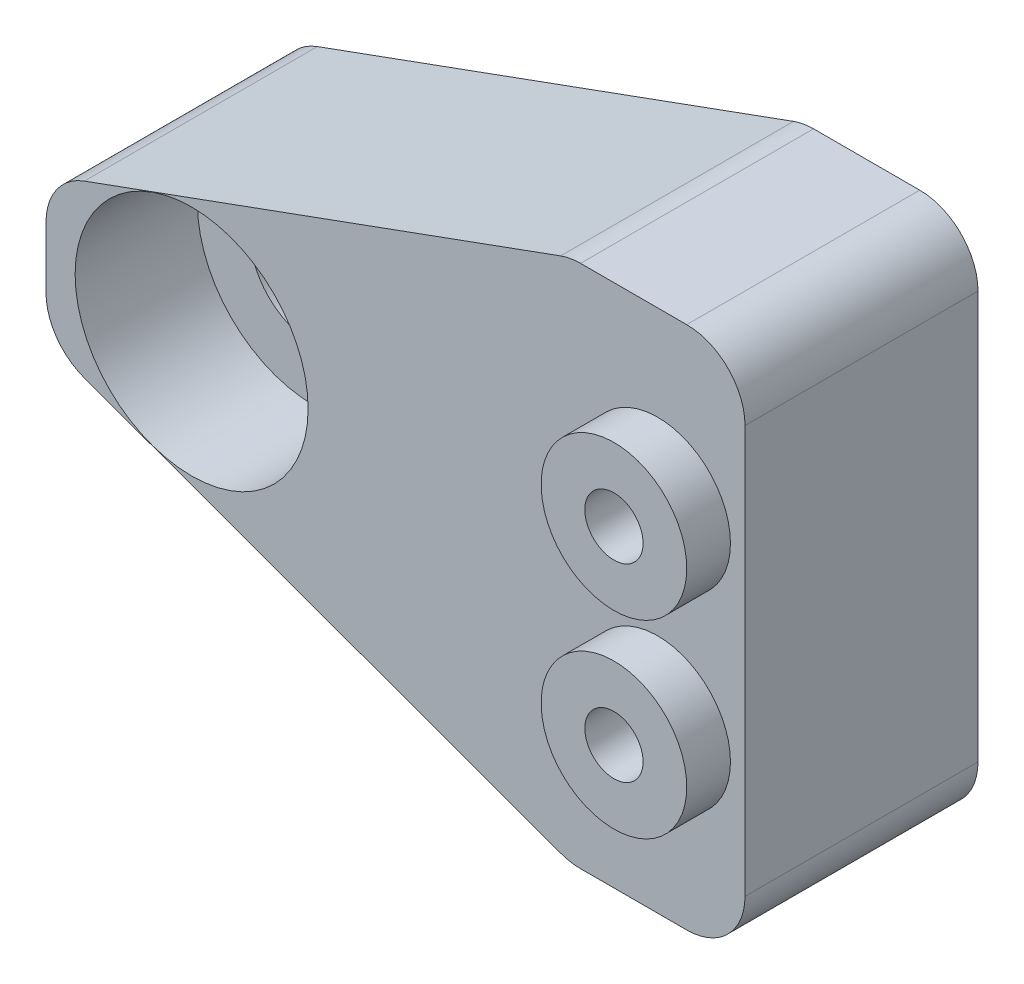
ISO-10303-21;
HEADER;
FILE_DESCRIPTION(('STEP AP214'),'2;1');
FILE_NAME('part.step','',(''),(''),'','','');
FILE_SCHEMA(('AUTOMOTIVE_DESIGN { 1 0 10303 214 1 1 1 1 }'));
ENDSEC;
DATA;
#1=APPLICATION_CONTEXT('core data for automotive mechanical design processes');
#2=APPLICATION_PROTOCOL_DEFINITION('international standard','automotive_design',2000,#1);
#3=PRODUCT_CONTEXT('',#1,'mechanical');
#4=PRODUCT('Part','Part','',(#3));
#5=PRODUCT_RELATED_PRODUCT_CATEGORY('part','',(#4));
#6=PRODUCT_DEFINITION_FORMATION('','',#4);
#7=PRODUCT_DEFINITION_CONTEXT('part definition',#1,'design');
#8=PRODUCT_DEFINITION('design','',#6,#7);
#9=PRODUCT_DEFINITION_SHAPE('','',#8);
#10=(LENGTH_UNIT() NAMED_UNIT(*) SI_UNIT(.MILLI.,.METRE.));
#11=(NAMED_UNIT(*) PLANE_ANGLE_UNIT() SI_UNIT($,.RADIAN.));
#12=(NAMED_UNIT(*) SI_UNIT($,.STERADIAN.) SOLID_ANGLE_UNIT());
#13=UNCERTAINTY_MEASURE_WITH_UNIT(LENGTH_MEASURE(1.E-05),#10,'distance_accuracy_value','');
#14=(GEOMETRIC_REPRESENTATION_CONTEXT(3) GLOBAL_UNCERTAINTY_ASSIGNED_CONTEXT((#13)) GLOBAL_UNIT_ASSIGNED_CONTEXT((#10,
#11,#12)) REPRESENTATION_CONTEXT('',''));
#15=CARTESIAN_POINT('',(0.,0.,0.));
#16=DIRECTION('',(0.,0.,1.));
#17=DIRECTION('',(1.,0.,0.));
#18=AXIS2_PLACEMENT_3D('',#15,#16,#17);
#19=CARTESIAN_POINT('',(0.,0.,8.));
#20=DIRECTION('',(0.,0.,1.));
#21=DIRECTION('',(1.,0.,0.));
#22=AXIS2_PLACEMENT_3D('',#19,#20,#21);
#23=PLANE('',#22);
#24=CARTESIAN_POINT('',(13.,-3.25,8.));
#25=DIRECTION('',(0.,0.,1.));
#26=DIRECTION('',(1.,0.,0.));
#27=AXIS2_PLACEMENT_3D('',#24,#25,#26);
#28=CIRCLE('',#27,2.5);
#29=CARTESIAN_POINT('',(15.5,-3.25,8.));
#30=VERTEX_POINT('',#29);
#31=EDGE_CURVE('E333',#30,#30,#28,.T.);
#32=ORIENTED_EDGE('',*,*,#31,.F.);
#33=EDGE_LOOP('',(#32));
#34=FACE_BOUND('',#33,.T.);
#35=CARTESIAN_POINT('',(-3.,0.,8.));
#36=DIRECTION('',(0.,0.,1.));
#37=DIRECTION('',(1.,0.,0.));
#38=AXIS2_PLACEMENT_3D('',#35,#36,#37);
#39=CIRCLE('',#38,4.);
#40=CARTESIAN_POINT('',(0.999999999999998,0.,8.));
#41=VERTEX_POINT('',#40);
#42=EDGE_CURVE('E315',#41,#41,#39,.T.);
#43=ORIENTED_EDGE('',*,*,#42,.F.);
#44=EDGE_LOOP('',(#43));
#45=FACE_BOUND('',#44,.T.);
#46=DIRECTION('',(-0.93969262078591,0.342020143325666,0.));
#47=VECTOR('',#46,1.);
#48=CARTESIAN_POINT('',(-1.72276645918429,-4.73326194560269,8.));
#49=LINE('',#48,#47);
#50=CARTESIAN_POINT('',(-6.68404028665133,-2.92750594836075,8.));
#51=VERTEX_POINT('',#50);
#52=CARTESIAN_POINT('',(9.66861367476577,-8.87938524157182,8.));
#53=VERTEX_POINT('',#52);
#54=EDGE_CURVE('E129',#51,#53,#49,.F.);
#55=ORIENTED_EDGE('',*,*,#54,.T.);
#56=CARTESIAN_POINT('',(10.3526539614171,-7.,8.));
#57=DIRECTION('',(0.,0.,1.));
#58=DIRECTION('',(1.,0.,0.));
#59=AXIS2_PLACEMENT_3D('',#56,#57,#58);
#60=CIRCLE('',#59,2.);
#61=CARTESIAN_POINT('',(10.3526539614171,-9.,8.));
#62=VERTEX_POINT('',#61);
#63=EDGE_CURVE('E123',#53,#62,#60,.T.);
#64=ORIENTED_EDGE('',*,*,#63,.T.);
#65=DIRECTION('',(1.,0.,0.));
#66=VECTOR('',#65,1.);
#67=CARTESIAN_POINT('',(-8.,-9.,8.));
#68=LINE('',#67,#66);
#69=CARTESIAN_POINT('',(14.,-9.,8.));
#70=VERTEX_POINT('',#69);
#71=EDGE_CURVE('E126',#62,#70,#68,.T.);
#72=ORIENTED_EDGE('',*,*,#71,.T.);
#73=CARTESIAN_POINT('',(14.,-7.,8.));
#74=DIRECTION('',(0.,0.,1.));
#75=DIRECTION('',(1.,0.,0.));
#76=AXIS2_PLACEMENT_3D('',#73,#74,#75);
#77=CIRCLE('',#76,2.);
#78=CARTESIAN_POINT('',(16.,-7.,8.));
#79=VERTEX_POINT('',#78);
#80=EDGE_CURVE('E134',#70,#79,#77,.T.);
#81=ORIENTED_EDGE('',*,*,#80,.T.);
#82=DIRECTION('',(0.,1.,0.));
#83=VECTOR('',#82,1.);
#84=CARTESIAN_POINT('',(16.,9.,8.));
#85=LINE('',#84,#83);
#86=CARTESIAN_POINT('',(16.,7.,8.));
#87=VERTEX_POINT('',#86);
#88=EDGE_CURVE('E144',#79,#87,#85,.T.);
#89=ORIENTED_EDGE('',*,*,#88,.T.);
#90=CARTESIAN_POINT('',(14.,7.,8.));
#91=DIRECTION('',(0.,0.,1.));
#92=DIRECTION('',(1.,0.,0.));
#93=AXIS2_PLACEMENT_3D('',#90,#91,#92);
#94=CIRCLE('',#93,2.);
#95=CARTESIAN_POINT('',(14.,9.,8.));
#96=VERTEX_POINT('',#95);
#97=EDGE_CURVE('E173',#87,#96,#94,.T.);
#98=ORIENTED_EDGE('',*,*,#97,.T.);
#99=DIRECTION('',(-1.,0.,0.));
#100=VECTOR('',#99,1.);
#101=CARTESIAN_POINT('',(-8.,9.,8.));
#102=LINE('',#101,#100);
#103=CARTESIAN_POINT('',(10.3526539614171,9.,8.));
#104=VERTEX_POINT('',#103);
#105=EDGE_CURVE('E214',#96,#104,#102,.T.);
#106=ORIENTED_EDGE('',*,*,#105,.T.);
#107=CARTESIAN_POINT('',(10.3526539614171,7.,8.));
#108=DIRECTION('',(0.,0.,1.));
#109=DIRECTION('',(1.,0.,0.));
#110=AXIS2_PLACEMENT_3D('',#107,#108,#109);
#111=CIRCLE('',#110,2.);
#112=CARTESIAN_POINT('',(9.66861367476575,8.87938524157182,8.));
#113=VERTEX_POINT('',#112);
#114=EDGE_CURVE('E55',#104,#113,#111,.T.);
#115=ORIENTED_EDGE('',*,*,#114,.T.);
#116=DIRECTION('',(0.939692620785909,0.342020143325666,0.));
#117=VECTOR('',#116,1.);
#118=CARTESIAN_POINT('',(-1.7227664591843,4.73326194560269,8.));
#119=LINE('',#118,#117);
#120=CARTESIAN_POINT('',(-6.68404028665133,2.92750594836075,8.));
#121=VERTEX_POINT('',#120);
#122=EDGE_CURVE('E235',#113,#121,#119,.F.);
#123=ORIENTED_EDGE('',*,*,#122,.T.);
#124=CARTESIAN_POINT('',(-6.,1.04812070678893,8.));
#125=DIRECTION('',(0.,0.,1.));
#126=DIRECTION('',(1.,0.,0.));
#127=AXIS2_PLACEMENT_3D('',#124,#125,#126);
#128=CIRCLE('',#127,2.);
#129=CARTESIAN_POINT('',(-8.,1.04812070678893,8.));
#130=VERTEX_POINT('',#129);
#131=EDGE_CURVE('E168',#121,#130,#128,.T.);
#132=ORIENTED_EDGE('',*,*,#131,.T.);
#133=DIRECTION('',(0.,-1.,0.));
#134=VECTOR('',#133,1.);
#135=CARTESIAN_POINT('',(-8.,9.,8.));
#136=LINE('',#135,#134);
#137=CARTESIAN_POINT('',(-8.,-1.04812070678893,8.));
#138=VERTEX_POINT('',#137);
#139=EDGE_CURVE('E145',#130,#138,#136,.T.);
#140=ORIENTED_EDGE('',*,*,#139,.T.);
#141=CARTESIAN_POINT('',(-6.,-1.04812070678893,8.));
#142=DIRECTION('',(0.,0.,1.));
#143=DIRECTION('',(1.,0.,0.));
#144=AXIS2_PLACEMENT_3D('',#141,#142,#143);
#145=CIRCLE('',#144,2.);
#146=EDGE_CURVE('E170',#138,#51,#145,.T.);
#147=ORIENTED_EDGE('',*,*,#146,.T.);
#148=EDGE_LOOP('',(#55,#64,#72,#81,#89,#98,#106,#115,#123,#132,#140,#147));
#149=FACE_BOUND('',#148,.T.);
#150=CARTESIAN_POINT('',(13.,3.25,8.));
#151=DIRECTION('',(0.,0.,1.));
#152=DIRECTION('',(1.,0.,0.));
#153=AXIS2_PLACEMENT_3D('',#150,#151,#152);
#154=CIRCLE('',#153,2.5);
#155=CARTESIAN_POINT('',(15.5,3.25,8.));
#156=VERTEX_POINT('',#155);
#157=EDGE_CURVE('E342',#156,#156,#154,.T.);
#158=ORIENTED_EDGE('',*,*,#157,.F.);
#159=EDGE_LOOP('',(#158));
#160=FACE_BOUND('',#159,.T.);
#161=ADVANCED_FACE('F33',(#34,#45,#149,#160),#23,.T.);
#162=CARTESIAN_POINT('',(-3.,0.,0.));
#163=DIRECTION('',(0.,0.,1.));
#164=DIRECTION('',(1.,0.,0.));
#165=AXIS2_PLACEMENT_3D('',#162,#163,#164);
#166=CYLINDRICAL_SURFACE('',#165,2.2);
#167=CARTESIAN_POINT('',(-3.,0.,0.));
#168=DIRECTION('',(0.,0.,1.));
#169=DIRECTION('',(1.,0.,0.));
#170=AXIS2_PLACEMENT_3D('',#167,#168,#169);
#171=CIRCLE('',#170,2.2);
#172=CARTESIAN_POINT('',(-0.800000000000002,0.,0.));
#173=VERTEX_POINT('',#172);
#174=EDGE_CURVE('E206',#173,#173,#171,.T.);
#175=ORIENTED_EDGE('',*,*,#174,.F.);
#176=EDGE_LOOP('',(#175));
#177=FACE_BOUND('',#176,.T.);
#178=CARTESIAN_POINT('',(-3.,0.,3.8));
#179=DIRECTION('',(0.,0.,1.));
#180=DIRECTION('',(1.,0.,0.));
#181=AXIS2_PLACEMENT_3D('',#178,#179,#180);
#182=CIRCLE('',#181,2.2);
#183=CARTESIAN_POINT('',(-0.800000000000002,0.,3.8));
#184=VERTEX_POINT('',#183);
#185=EDGE_CURVE('E211',#184,#184,#182,.F.);
#186=ORIENTED_EDGE('',*,*,#185,.F.);
#187=EDGE_LOOP('',(#186));
#188=FACE_BOUND('',#187,.T.);
#189=ADVANCED_FACE('F250',(#177,#188),#166,.F.);
#190=CARTESIAN_POINT('',(-8.,9.,8.));
#191=DIRECTION('',(1.,0.,0.));
#192=DIRECTION('',(0.,1.,0.));
#193=AXIS2_PLACEMENT_3D('',#190,#191,#192);
#194=PLANE('',#193);
#195=DIRECTION('',(0.,-1.,0.));
#196=VECTOR('',#195,1.);
#197=CARTESIAN_POINT('',(-8.,9.,0.));
#198=LINE('',#197,#196);
#199=CARTESIAN_POINT('',(-8.,1.04812070678893,0.));
#200=VERTEX_POINT('',#199);
#201=CARTESIAN_POINT('',(-8.,-1.04812070678893,0.));
#202=VERTEX_POINT('',#201);
#203=EDGE_CURVE('E195',#200,#202,#198,.T.);
#204=ORIENTED_EDGE('',*,*,#203,.T.);
#205=DIRECTION('',(0.,0.,-1.));
#206=VECTOR('',#205,1.);
#207=CARTESIAN_POINT('',(-8.,-1.04812070678893,8.));
#208=LINE('',#207,#206);
#209=EDGE_CURVE('E11',#202,#138,#208,.F.);
#210=ORIENTED_EDGE('',*,*,#209,.T.);
#211=ORIENTED_EDGE('',*,*,#139,.F.);
#212=DIRECTION('',(0.,0.,1.));
#213=VECTOR('',#212,1.);
#214=CARTESIAN_POINT('',(-8.,1.04812070678893,0.));
#215=LINE('',#214,#213);
#216=EDGE_CURVE('E41',#130,#200,#215,.F.);
#217=ORIENTED_EDGE('',*,*,#216,.T.);
#218=EDGE_LOOP('',(#204,#210,#211,#217));
#219=FACE_BOUND('',#218,.T.);
#220=ADVANCED_FACE('F194',(#219),#194,.F.);
#221=CARTESIAN_POINT('',(-8.,-9.,8.));
#222=DIRECTION('',(0.,1.,0.));
#223=DIRECTION('',(-1.,0.,0.));
#224=AXIS2_PLACEMENT_3D('',#221,#222,#223);
#225=PLANE('',#224);
#226=ORIENTED_EDGE('',*,*,#71,.F.);
#227=DIRECTION('',(0.,0.,1.));
#228=VECTOR('',#227,1.);
#229=CARTESIAN_POINT('',(10.3526539614171,-9.,0.));
#230=LINE('',#229,#228);
#231=CARTESIAN_POINT('',(10.3526539614171,-9.,0.));
#232=VERTEX_POINT('',#231);
#233=EDGE_CURVE('E140',#62,#232,#230,.F.);
#234=ORIENTED_EDGE('',*,*,#233,.T.);
#235=DIRECTION('',(1.,0.,0.));
#236=VECTOR('',#235,1.);
#237=CARTESIAN_POINT('',(-8.,-9.,0.));
#238=LINE('',#237,#236);
#239=CARTESIAN_POINT('',(14.,-9.,0.));
#240=VERTEX_POINT('',#239);
#241=EDGE_CURVE('E205',#232,#240,#238,.T.);
#242=ORIENTED_EDGE('',*,*,#241,.T.);
#243=DIRECTION('',(0.,0.,-1.));
#244=VECTOR('',#243,1.);
#245=CARTESIAN_POINT('',(14.,-9.,8.));
#246=LINE('',#245,#244);
#247=EDGE_CURVE('E143',#240,#70,#246,.F.);
#248=ORIENTED_EDGE('',*,*,#247,.T.);
#249=EDGE_LOOP('',(#226,#234,#242,#248));
#250=FACE_BOUND('',#249,.T.);
#251=ADVANCED_FACE('F138',(#250),#225,.F.);
#252=CARTESIAN_POINT('',(16.,9.,8.));
#253=DIRECTION('',(-1.,0.,0.));
#254=DIRECTION('',(0.,-1.,0.));
#255=AXIS2_PLACEMENT_3D('',#252,#253,#254);
#256=PLANE('',#255);
#257=ORIENTED_EDGE('',*,*,#88,.F.);
#258=DIRECTION('',(0.,0.,-1.));
#259=VECTOR('',#258,1.);
#260=CARTESIAN_POINT('',(16.,-7.,8.));
#261=LINE('',#260,#259);
#262=CARTESIAN_POINT('',(16.,-7.,0.));
#263=VERTEX_POINT('',#262);
#264=EDGE_CURVE('E177',#79,#263,#261,.T.);
#265=ORIENTED_EDGE('',*,*,#264,.T.);
#266=DIRECTION('',(0.,1.,0.));
#267=VECTOR('',#266,1.);
#268=CARTESIAN_POINT('',(16.,9.,0.));
#269=LINE('',#268,#267);
#270=CARTESIAN_POINT('',(16.,7.,0.));
#271=VERTEX_POINT('',#270);
#272=EDGE_CURVE('E208',#263,#271,#269,.T.);
#273=ORIENTED_EDGE('',*,*,#272,.T.);
#274=DIRECTION('',(0.,0.,-1.));
#275=VECTOR('',#274,1.);
#276=CARTESIAN_POINT('',(16.,7.,8.));
#277=LINE('',#276,#275);
#278=EDGE_CURVE('E133',#271,#87,#277,.F.);
#279=ORIENTED_EDGE('',*,*,#278,.T.);
#280=EDGE_LOOP('',(#257,#265,#273,#279));
#281=FACE_BOUND('',#280,.T.);
#282=ADVANCED_FACE('F269',(#281),#256,.F.);
#283=CARTESIAN_POINT('',(-8.,9.,8.));
#284=DIRECTION('',(0.,-1.,0.));
#285=DIRECTION('',(0.,0.,-1.));
#286=AXIS2_PLACEMENT_3D('',#283,#284,#285);
#287=PLANE('',#286);
#288=ORIENTED_EDGE('',*,*,#105,.F.);
#289=DIRECTION('',(0.,0.,-1.));
#290=VECTOR('',#289,1.);
#291=CARTESIAN_POINT('',(14.,9.,8.));
#292=LINE('',#291,#290);
#293=CARTESIAN_POINT('',(14.,9.,0.));
#294=VERTEX_POINT('',#293);
#295=EDGE_CURVE('E183',#96,#294,#292,.T.);
#296=ORIENTED_EDGE('',*,*,#295,.T.);
#297=DIRECTION('',(-1.,0.,0.));
#298=VECTOR('',#297,1.);
#299=CARTESIAN_POINT('',(-8.,9.,0.));
#300=LINE('',#299,#298);
#301=CARTESIAN_POINT('',(10.3526539614171,9.,0.));
#302=VERTEX_POINT('',#301);
#303=EDGE_CURVE('E219',#294,#302,#300,.T.);
#304=ORIENTED_EDGE('',*,*,#303,.T.);
#305=DIRECTION('',(0.,0.,-1.));
#306=VECTOR('',#305,1.);
#307=CARTESIAN_POINT('',(10.3526539614171,9.,8.));
#308=LINE('',#307,#306);
#309=EDGE_CURVE('E180',#302,#104,#308,.F.);
#310=ORIENTED_EDGE('',*,*,#309,.T.);
#311=EDGE_LOOP('',(#288,#296,#304,#310));
#312=FACE_BOUND('',#311,.T.);
#313=ADVANCED_FACE('F265',(#312),#287,.F.);
#314=CARTESIAN_POINT('',(0.,0.,0.));
#315=DIRECTION('',(0.,0.,1.));
#316=DIRECTION('',(1.,0.,0.));
#317=AXIS2_PLACEMENT_3D('',#314,#315,#316);
#318=PLANE('',#317);
#319=CARTESIAN_POINT('',(13.,-3.25,0.));
#320=DIRECTION('',(0.,0.,-1.));
#321=DIRECTION('',(-1.,0.,0.));
#322=AXIS2_PLACEMENT_3D('',#319,#320,#321);
#323=CIRCLE('',#322,2.6);
#324=CARTESIAN_POINT('',(10.4,-3.25,0.));
#325=VERTEX_POINT('',#324);
#326=EDGE_CURVE('E327',#325,#325,#323,.T.);
#327=ORIENTED_EDGE('',*,*,#326,.F.);
#328=EDGE_LOOP('',(#327));
#329=FACE_BOUND('',#328,.T.);
#330=CARTESIAN_POINT('',(13.,3.25,0.));
#331=DIRECTION('',(0.,0.,-1.));
#332=DIRECTION('',(-1.,0.,0.));
#333=AXIS2_PLACEMENT_3D('',#330,#331,#332);
#334=CIRCLE('',#333,2.6);
#335=CARTESIAN_POINT('',(10.4,3.25,0.));
#336=VERTEX_POINT('',#335);
#337=EDGE_CURVE('E321',#336,#336,#334,.T.);
#338=ORIENTED_EDGE('',*,*,#337,.F.);
#339=EDGE_LOOP('',(#338));
#340=FACE_BOUND('',#339,.T.);
#341=ORIENTED_EDGE('',*,*,#174,.T.);
#342=EDGE_LOOP('',(#341));
#343=FACE_BOUND('',#342,.T.);
#344=ORIENTED_EDGE('',*,*,#241,.F.);
#345=CARTESIAN_POINT('',(10.3526539614171,-7.,0.));
#346=DIRECTION('',(0.,0.,1.));
#347=DIRECTION('',(1.,0.,0.));
#348=AXIS2_PLACEMENT_3D('',#345,#346,#347);
#349=CIRCLE('',#348,2.);
#350=CARTESIAN_POINT('',(9.66861367476577,-8.87938524157182,0.));
#351=VERTEX_POINT('',#350);
#352=EDGE_CURVE('E148',#232,#351,#349,.F.);
#353=ORIENTED_EDGE('',*,*,#352,.T.);
#354=DIRECTION('',(0.93969262078591,-0.342020143325666,0.));
#355=VECTOR('',#354,1.);
#356=CARTESIAN_POINT('',(10.0000000000002,-9.,0.));
#357=LINE('',#356,#355);
#358=CARTESIAN_POINT('',(-6.68404028665134,-2.92750594836074,0.));
#359=VERTEX_POINT('',#358);
#360=EDGE_CURVE('E233',#351,#359,#357,.F.);
#361=ORIENTED_EDGE('',*,*,#360,.T.);
#362=CARTESIAN_POINT('',(-6.,-1.04812070678893,0.));
#363=DIRECTION('',(0.,0.,1.));
#364=DIRECTION('',(1.,0.,0.));
#365=AXIS2_PLACEMENT_3D('',#362,#363,#364);
#366=CIRCLE('',#365,2.);
#367=EDGE_CURVE('E151',#359,#202,#366,.F.);
#368=ORIENTED_EDGE('',*,*,#367,.T.);
#369=ORIENTED_EDGE('',*,*,#203,.F.);
#370=CARTESIAN_POINT('',(-6.,1.04812070678893,0.));
#371=DIRECTION('',(0.,0.,1.));
#372=DIRECTION('',(1.,0.,0.));
#373=AXIS2_PLACEMENT_3D('',#370,#371,#372);
#374=CIRCLE('',#373,2.);
#375=CARTESIAN_POINT('',(-6.68404028665133,2.92750594836075,0.));
#376=VERTEX_POINT('',#375);
#377=EDGE_CURVE('E149',#200,#376,#374,.F.);
#378=ORIENTED_EDGE('',*,*,#377,.T.);
#379=DIRECTION('',(-0.939692620785909,-0.342020143325666,0.));
#380=VECTOR('',#379,1.);
#381=CARTESIAN_POINT('',(-8.,2.44853578320835,0.));
#382=LINE('',#381,#380);
#383=CARTESIAN_POINT('',(9.66861367476575,8.87938524157182,0.));
#384=VERTEX_POINT('',#383);
#385=EDGE_CURVE('E231',#376,#384,#382,.F.);
#386=ORIENTED_EDGE('',*,*,#385,.T.);
#387=CARTESIAN_POINT('',(10.3526539614171,7.,0.));
#388=DIRECTION('',(0.,0.,1.));
#389=DIRECTION('',(1.,0.,0.));
#390=AXIS2_PLACEMENT_3D('',#387,#388,#389);
#391=CIRCLE('',#390,2.);
#392=EDGE_CURVE('E157',#384,#302,#391,.F.);
#393=ORIENTED_EDGE('',*,*,#392,.T.);
#394=ORIENTED_EDGE('',*,*,#303,.F.);
#395=CARTESIAN_POINT('',(14.,7.,0.));
#396=DIRECTION('',(0.,0.,1.));
#397=DIRECTION('',(1.,0.,0.));
#398=AXIS2_PLACEMENT_3D('',#395,#396,#397);
#399=CIRCLE('',#398,2.);
#400=EDGE_CURVE('E159',#294,#271,#399,.F.);
#401=ORIENTED_EDGE('',*,*,#400,.T.);
#402=ORIENTED_EDGE('',*,*,#272,.F.);
#403=CARTESIAN_POINT('',(14.,-7.,0.));
#404=DIRECTION('',(0.,0.,1.));
#405=DIRECTION('',(1.,0.,0.));
#406=AXIS2_PLACEMENT_3D('',#403,#404,#405);
#407=CIRCLE('',#406,2.);
#408=EDGE_CURVE('E161',#263,#240,#407,.F.);
#409=ORIENTED_EDGE('',*,*,#408,.T.);
#410=EDGE_LOOP('',(#344,#353,#361,#368,#369,#378,#386,#393,#394,#401,#402,#409));
#411=FACE_BOUND('',#410,.T.);
#412=ADVANCED_FACE('F201',(#329,#340,#343,#411),#318,.F.);
#413=CARTESIAN_POINT('',(-3.,0.,3.8));
#414=DIRECTION('',(0.,0.,1.));
#415=DIRECTION('',(1.,0.,0.));
#416=AXIS2_PLACEMENT_3D('',#413,#414,#415);
#417=PLANE('',#416);
#418=CARTESIAN_POINT('',(-3.,0.,3.8));
#419=DIRECTION('',(0.,0.,1.));
#420=DIRECTION('',(1.,0.,0.));
#421=AXIS2_PLACEMENT_3D('',#418,#419,#420);
#422=CIRCLE('',#421,4.);
#423=CARTESIAN_POINT('',(0.999999999999998,0.,3.8));
#424=VERTEX_POINT('',#423);
#425=EDGE_CURVE('E224',#424,#424,#422,.T.);
#426=ORIENTED_EDGE('',*,*,#425,.T.);
#427=EDGE_LOOP('',(#426));
#428=FACE_BOUND('',#427,.T.);
#429=ORIENTED_EDGE('',*,*,#185,.T.);
#430=EDGE_LOOP('',(#429));
#431=FACE_BOUND('',#430,.T.);
#432=ADVANCED_FACE('F264',(#428,#431),#417,.T.);
#433=CARTESIAN_POINT('',(-3.,0.,3.8));
#434=DIRECTION('',(0.,0.,1.));
#435=DIRECTION('',(1.,0.,0.));
#436=AXIS2_PLACEMENT_3D('',#433,#434,#435);
#437=CYLINDRICAL_SURFACE('',#436,4.);
#438=ORIENTED_EDGE('',*,*,#425,.F.);
#439=EDGE_LOOP('',(#438));
#440=FACE_BOUND('',#439,.T.);
#441=ORIENTED_EDGE('',*,*,#42,.T.);
#442=EDGE_LOOP('',(#441));
#443=FACE_BOUND('',#442,.T.);
#444=ADVANCED_FACE('F390',(#440,#443),#437,.F.);
#445=CARTESIAN_POINT('',(13.,3.25,4.2));
#446=DIRECTION('',(0.,0.,-1.));
#447=DIRECTION('',(-1.,0.,0.));
#448=AXIS2_PLACEMENT_3D('',#445,#446,#447);
#449=PLANE('',#448);
#450=CARTESIAN_POINT('',(13.,3.25,4.2));
#451=DIRECTION('',(0.,0.,-1.));
#452=DIRECTION('',(-1.,0.,0.));
#453=AXIS2_PLACEMENT_3D('',#450,#451,#452);
#454=CIRCLE('',#453,2.6);
#455=CARTESIAN_POINT('',(10.4,3.25,4.2));
#456=VERTEX_POINT('',#455);
#457=EDGE_CURVE('E318',#456,#456,#454,.T.);
#458=ORIENTED_EDGE('',*,*,#457,.T.);
#459=EDGE_LOOP('',(#458));
#460=FACE_BOUND('',#459,.T.);
#461=ADVANCED_FACE('F387',(#460),#449,.T.);
#462=CARTESIAN_POINT('',(13.,3.25,4.2));
#463=DIRECTION('',(0.,0.,-1.));
#464=DIRECTION('',(-1.,0.,0.));
#465=AXIS2_PLACEMENT_3D('',#462,#463,#464);
#466=CYLINDRICAL_SURFACE('',#465,2.6);
#467=ORIENTED_EDGE('',*,*,#457,.F.);
#468=EDGE_LOOP('',(#467));
#469=FACE_BOUND('',#468,.T.);
#470=ORIENTED_EDGE('',*,*,#337,.T.);
#471=EDGE_LOOP('',(#470));
#472=FACE_BOUND('',#471,.T.);
#473=ADVANCED_FACE('F382',(#469,#472),#466,.F.);
#474=CARTESIAN_POINT('',(13.,-3.25,4.2));
#475=DIRECTION('',(0.,0.,-1.));
#476=DIRECTION('',(-1.,0.,0.));
#477=AXIS2_PLACEMENT_3D('',#474,#475,#476);
#478=PLANE('',#477);
#479=CARTESIAN_POINT('',(13.,-3.25,4.2));
#480=DIRECTION('',(0.,0.,-1.));
#481=DIRECTION('',(-1.,0.,0.));
#482=AXIS2_PLACEMENT_3D('',#479,#480,#481);
#483=CIRCLE('',#482,2.6);
#484=CARTESIAN_POINT('',(10.4,-3.25,4.2));
#485=VERTEX_POINT('',#484);
#486=EDGE_CURVE('E324',#485,#485,#483,.T.);
#487=ORIENTED_EDGE('',*,*,#486,.T.);
#488=EDGE_LOOP('',(#487));
#489=FACE_BOUND('',#488,.T.);
#490=ADVANCED_FACE('F379',(#489),#478,.T.);
#491=CARTESIAN_POINT('',(13.,-3.25,4.2));
#492=DIRECTION('',(0.,0.,-1.));
#493=DIRECTION('',(-1.,0.,0.));
#494=AXIS2_PLACEMENT_3D('',#491,#492,#493);
#495=CYLINDRICAL_SURFACE('',#494,2.6);
#496=ORIENTED_EDGE('',*,*,#486,.F.);
#497=EDGE_LOOP('',(#496));
#498=FACE_BOUND('',#497,.T.);
#499=ORIENTED_EDGE('',*,*,#326,.T.);
#500=EDGE_LOOP('',(#499));
#501=FACE_BOUND('',#500,.T.);
#502=ADVANCED_FACE('F282',(#498,#501),#495,.F.);
#503=CARTESIAN_POINT('',(10.0000000000002,-9.,8.));
#504=DIRECTION('',(0.342020143325666,0.939692620785909,0.));
#505=DIRECTION('',(0.,0.,-1.));
#506=AXIS2_PLACEMENT_3D('',#503,#504,#505);
#507=PLANE('',#506);
#508=ORIENTED_EDGE('',*,*,#360,.F.);
#509=DIRECTION('',(0.,0.,-1.));
#510=VECTOR('',#509,1.);
#511=CARTESIAN_POINT('',(9.66861367476577,-8.87938524157182,8.));
#512=LINE('',#511,#510);
#513=EDGE_CURVE('E166',#351,#53,#512,.F.);
#514=ORIENTED_EDGE('',*,*,#513,.T.);
#515=ORIENTED_EDGE('',*,*,#54,.F.);
#516=DIRECTION('',(0.,0.,1.));
#517=VECTOR('',#516,1.);
#518=CARTESIAN_POINT('',(-6.68404028665133,-2.92750594836075,0.));
#519=LINE('',#518,#517);
#520=EDGE_CURVE('E164',#51,#359,#519,.F.);
#521=ORIENTED_EDGE('',*,*,#520,.T.);
#522=EDGE_LOOP('',(#508,#514,#515,#521));
#523=FACE_BOUND('',#522,.T.);
#524=ADVANCED_FACE('F278',(#523),#507,.F.);
#525=CARTESIAN_POINT('',(-8.,2.44853578320835,8.));
#526=DIRECTION('',(0.342020143325666,-0.939692620785909,0.));
#527=DIRECTION('',(0.,0.,-1.));
#528=AXIS2_PLACEMENT_3D('',#525,#526,#527);
#529=PLANE('',#528);
#530=ORIENTED_EDGE('',*,*,#122,.F.);
#531=DIRECTION('',(0.,0.,1.));
#532=VECTOR('',#531,1.);
#533=CARTESIAN_POINT('',(9.66861367476575,8.87938524157182,0.));
#534=LINE('',#533,#532);
#535=EDGE_CURVE('E187',#113,#384,#534,.F.);
#536=ORIENTED_EDGE('',*,*,#535,.T.);
#537=ORIENTED_EDGE('',*,*,#385,.F.);
#538=DIRECTION('',(0.,0.,-1.));
#539=VECTOR('',#538,1.);
#540=CARTESIAN_POINT('',(-6.68404028665133,2.92750594836075,8.));
#541=LINE('',#540,#539);
#542=EDGE_CURVE('E48',#376,#121,#541,.F.);
#543=ORIENTED_EDGE('',*,*,#542,.T.);
#544=EDGE_LOOP('',(#530,#536,#537,#543));
#545=FACE_BOUND('',#544,.T.);
#546=ADVANCED_FACE('F281',(#545),#529,.F.);
#547=CARTESIAN_POINT('',(10.3526539614171,-7.,8.));
#548=DIRECTION('',(0.,0.,-1.));
#549=DIRECTION('',(-1.,0.,0.));
#550=AXIS2_PLACEMENT_3D('',#547,#548,#549);
#551=CYLINDRICAL_SURFACE('',#550,2.);
#552=ORIENTED_EDGE('',*,*,#63,.F.);
#553=ORIENTED_EDGE('',*,*,#513,.F.);
#554=ORIENTED_EDGE('',*,*,#352,.F.);
#555=ORIENTED_EDGE('',*,*,#233,.F.);
#556=EDGE_LOOP('',(#552,#553,#554,#555));
#557=FACE_BOUND('',#556,.T.);
#558=ADVANCED_FACE('F147',(#557),#551,.T.);
#559=CARTESIAN_POINT('',(14.,-7.,8.));
#560=DIRECTION('',(0.,0.,-1.));
#561=DIRECTION('',(-1.,0.,0.));
#562=AXIS2_PLACEMENT_3D('',#559,#560,#561);
#563=CYLINDRICAL_SURFACE('',#562,2.);
#564=ORIENTED_EDGE('',*,*,#80,.F.);
#565=ORIENTED_EDGE('',*,*,#247,.F.);
#566=ORIENTED_EDGE('',*,*,#408,.F.);
#567=ORIENTED_EDGE('',*,*,#264,.F.);
#568=EDGE_LOOP('',(#564,#565,#566,#567));
#569=FACE_BOUND('',#568,.T.);
#570=ADVANCED_FACE('F288',(#569),#563,.T.);
#571=CARTESIAN_POINT('',(14.,7.,8.));
#572=DIRECTION('',(0.,0.,-1.));
#573=DIRECTION('',(-1.,0.,0.));
#574=AXIS2_PLACEMENT_3D('',#571,#572,#573);
#575=CYLINDRICAL_SURFACE('',#574,2.);
#576=ORIENTED_EDGE('',*,*,#97,.F.);
#577=ORIENTED_EDGE('',*,*,#278,.F.);
#578=ORIENTED_EDGE('',*,*,#400,.F.);
#579=ORIENTED_EDGE('',*,*,#295,.F.);
#580=EDGE_LOOP('',(#576,#577,#578,#579));
#581=FACE_BOUND('',#580,.T.);
#582=ADVANCED_FACE('F291',(#581),#575,.T.);
#583=CARTESIAN_POINT('',(10.3526539614171,7.,8.));
#584=DIRECTION('',(0.,0.,1.));
#585=DIRECTION('',(1.,0.,0.));
#586=AXIS2_PLACEMENT_3D('',#583,#584,#585);
#587=CYLINDRICAL_SURFACE('',#586,2.);
#588=ORIENTED_EDGE('',*,*,#392,.F.);
#589=ORIENTED_EDGE('',*,*,#535,.F.);
#590=ORIENTED_EDGE('',*,*,#114,.F.);
#591=ORIENTED_EDGE('',*,*,#309,.F.);
#592=EDGE_LOOP('',(#588,#589,#590,#591));
#593=FACE_BOUND('',#592,.T.);
#594=ADVANCED_FACE('F247',(#593),#587,.T.);
#595=CARTESIAN_POINT('',(-6.,-1.04812070678893,8.));
#596=DIRECTION('',(0.,0.,1.));
#597=DIRECTION('',(1.,0.,0.));
#598=AXIS2_PLACEMENT_3D('',#595,#596,#597);
#599=CYLINDRICAL_SURFACE('',#598,2.);
#600=ORIENTED_EDGE('',*,*,#367,.F.);
#601=ORIENTED_EDGE('',*,*,#520,.F.);
#602=ORIENTED_EDGE('',*,*,#146,.F.);
#603=ORIENTED_EDGE('',*,*,#209,.F.);
#604=EDGE_LOOP('',(#600,#601,#602,#603));
#605=FACE_BOUND('',#604,.T.);
#606=ADVANCED_FACE('F239',(#605),#599,.T.);
#607=CARTESIAN_POINT('',(-6.,1.04812070678893,8.));
#608=DIRECTION('',(0.,0.,-1.));
#609=DIRECTION('',(-1.,0.,0.));
#610=AXIS2_PLACEMENT_3D('',#607,#608,#609);
#611=CYLINDRICAL_SURFACE('',#610,2.);
#612=ORIENTED_EDGE('',*,*,#131,.F.);
#613=ORIENTED_EDGE('',*,*,#542,.F.);
#614=ORIENTED_EDGE('',*,*,#377,.F.);
#615=ORIENTED_EDGE('',*,*,#216,.F.);
#616=EDGE_LOOP('',(#612,#613,#614,#615));
#617=FACE_BOUND('',#616,.T.);
#618=ADVANCED_FACE('F35',(#617),#611,.T.);
#619=CARTESIAN_POINT('',(13.,-3.25,9.5));
#620=DIRECTION('',(0.,0.,1.));
#621=DIRECTION('',(1.,0.,0.));
#622=AXIS2_PLACEMENT_3D('',#619,#620,#621);
#623=PLANE('',#622);
#624=CARTESIAN_POINT('',(13.,-3.25,9.5));
#625=DIRECTION('',(0.,0.,1.));
#626=DIRECTION('',(1.,0.,0.));
#627=AXIS2_PLACEMENT_3D('',#624,#625,#626);
#628=CIRCLE('',#627,2.5);
#629=CARTESIAN_POINT('',(15.5,-3.25,9.5));
#630=VERTEX_POINT('',#629);
#631=EDGE_CURVE('E330',#630,#630,#628,.T.);
#632=ORIENTED_EDGE('',*,*,#631,.T.);
#633=EDGE_LOOP('',(#632));
#634=FACE_BOUND('',#633,.T.);
#635=CARTESIAN_POINT('',(13.,-3.25,9.5));
#636=DIRECTION('',(0.,0.,1.));
#637=DIRECTION('',(1.,0.,0.));
#638=AXIS2_PLACEMENT_3D('',#635,#636,#637);
#639=CIRCLE('',#638,1.);
#640=CARTESIAN_POINT('',(14.,-3.25,9.5));
#641=VERTEX_POINT('',#640);
#642=EDGE_CURVE('E336',#641,#641,#639,.T.);
#643=ORIENTED_EDGE('',*,*,#642,.F.);
#644=EDGE_LOOP('',(#643));
#645=FACE_BOUND('',#644,.T.);
#646=ADVANCED_FACE('F238',(#634,#645),#623,.T.);
#647=CARTESIAN_POINT('',(13.,-3.25,9.5));
#648=DIRECTION('',(0.,0.,-1.));
#649=DIRECTION('',(-1.,0.,0.));
#650=AXIS2_PLACEMENT_3D('',#647,#648,#649);
#651=CYLINDRICAL_SURFACE('',#650,2.5);
#652=ORIENTED_EDGE('',*,*,#631,.F.);
#653=EDGE_LOOP('',(#652));
#654=FACE_BOUND('',#653,.T.);
#655=ORIENTED_EDGE('',*,*,#31,.T.);
#656=EDGE_LOOP('',(#655));
#657=FACE_BOUND('',#656,.T.);
#658=ADVANCED_FACE('F244',(#654,#657),#651,.T.);
#659=CARTESIAN_POINT('',(13.,-3.25,5.2));
#660=DIRECTION('',(0.,0.,-1.));
#661=DIRECTION('',(-1.,0.,0.));
#662=AXIS2_PLACEMENT_3D('',#659,#660,#661);
#663=PLANE('',#662);
#664=CARTESIAN_POINT('',(13.,-3.25,5.2));
#665=DIRECTION('',(0.,0.,-1.));
#666=DIRECTION('',(-1.,0.,0.));
#667=AXIS2_PLACEMENT_3D('',#664,#665,#666);
#668=CIRCLE('',#667,1.);
#669=CARTESIAN_POINT('',(12.,-3.25,5.2));
#670=VERTEX_POINT('',#669);
#671=EDGE_CURVE('E228',#670,#670,#668,.F.);
#672=ORIENTED_EDGE('',*,*,#671,.T.);
#673=EDGE_LOOP('',(#672));
#674=FACE_BOUND('',#673,.T.);
#675=ADVANCED_FACE('F366',(#674),#663,.F.);
#676=CARTESIAN_POINT('',(13.,-3.25,0.));
#677=DIRECTION('',(0.,0.,1.));
#678=DIRECTION('',(1.,0.,0.));
#679=AXIS2_PLACEMENT_3D('',#676,#677,#678);
#680=CYLINDRICAL_SURFACE('',#679,1.);
#681=ORIENTED_EDGE('',*,*,#671,.F.);
#682=EDGE_LOOP('',(#681));
#683=FACE_BOUND('',#682,.T.);
#684=ORIENTED_EDGE('',*,*,#642,.T.);
#685=EDGE_LOOP('',(#684));
#686=FACE_BOUND('',#685,.T.);
#687=ADVANCED_FACE('F356',(#683,#686),#680,.F.);
#688=CARTESIAN_POINT('',(13.,3.25,9.5));
#689=DIRECTION('',(0.,0.,1.));
#690=DIRECTION('',(1.,0.,0.));
#691=AXIS2_PLACEMENT_3D('',#688,#689,#690);
#692=PLANE('',#691);
#693=CARTESIAN_POINT('',(13.,3.25,9.5));
#694=DIRECTION('',(0.,0.,1.));
#695=DIRECTION('',(1.,0.,0.));
#696=AXIS2_PLACEMENT_3D('',#693,#694,#695);
#697=CIRCLE('',#696,2.5);
#698=CARTESIAN_POINT('',(15.5,3.25,9.5));
#699=VERTEX_POINT('',#698);
#700=EDGE_CURVE('E341',#699,#699,#697,.T.);
#701=ORIENTED_EDGE('',*,*,#700,.T.);
#702=EDGE_LOOP('',(#701));
#703=FACE_BOUND('',#702,.T.);
#704=CARTESIAN_POINT('',(13.,3.25,9.5));
#705=DIRECTION('',(0.,0.,1.));
#706=DIRECTION('',(1.,0.,0.));
#707=AXIS2_PLACEMENT_3D('',#704,#705,#706);
#708=CIRCLE('',#707,1.);
#709=CARTESIAN_POINT('',(14.,3.25,9.5));
#710=VERTEX_POINT('',#709);
#711=EDGE_CURVE('E345',#710,#710,#708,.T.);
#712=ORIENTED_EDGE('',*,*,#711,.F.);
#713=EDGE_LOOP('',(#712));
#714=FACE_BOUND('',#713,.T.);
#715=ADVANCED_FACE('F353',(#703,#714),#692,.T.);
#716=CARTESIAN_POINT('',(13.,3.25,9.5));
#717=DIRECTION('',(0.,0.,-1.));
#718=DIRECTION('',(-1.,0.,0.));
#719=AXIS2_PLACEMENT_3D('',#716,#717,#718);
#720=CYLINDRICAL_SURFACE('',#719,2.5);
#721=ORIENTED_EDGE('',*,*,#700,.F.);
#722=EDGE_LOOP('',(#721));
#723=FACE_BOUND('',#722,.T.);
#724=ORIENTED_EDGE('',*,*,#157,.T.);
#725=EDGE_LOOP('',(#724));
#726=FACE_BOUND('',#725,.T.);
#727=ADVANCED_FACE('F355',(#723,#726),#720,.T.);
#728=CARTESIAN_POINT('',(13.,3.25,5.2));
#729=DIRECTION('',(0.,0.,-1.));
#730=DIRECTION('',(-1.,0.,0.));
#731=AXIS2_PLACEMENT_3D('',#728,#729,#730);
#732=PLANE('',#731);
#733=CARTESIAN_POINT('',(13.,3.25,5.2));
#734=DIRECTION('',(0.,0.,-1.));
#735=DIRECTION('',(-1.,0.,0.));
#736=AXIS2_PLACEMENT_3D('',#733,#734,#735);
#737=CIRCLE('',#736,1.);
#738=CARTESIAN_POINT('',(12.,3.25,5.2));
#739=VERTEX_POINT('',#738);
#740=EDGE_CURVE('E225',#739,#739,#737,.F.);
#741=ORIENTED_EDGE('',*,*,#740,.T.);
#742=EDGE_LOOP('',(#741));
#743=FACE_BOUND('',#742,.T.);
#744=ADVANCED_FACE('F363',(#743),#732,.F.);
#745=CARTESIAN_POINT('',(13.,3.25,0.));
#746=DIRECTION('',(0.,0.,1.));
#747=DIRECTION('',(1.,0.,0.));
#748=AXIS2_PLACEMENT_3D('',#745,#746,#747);
#749=CYLINDRICAL_SURFACE('',#748,1.);
#750=ORIENTED_EDGE('',*,*,#740,.F.);
#751=EDGE_LOOP('',(#750));
#752=FACE_BOUND('',#751,.T.);
#753=ORIENTED_EDGE('',*,*,#711,.T.);
#754=EDGE_LOOP('',(#753));
#755=FACE_BOUND('',#754,.T.);
#756=ADVANCED_FACE('F351',(#752,#755),#749,.F.);
#757=CLOSED_SHELL('',(#161,#189,#220,#251,#282,#313,#412,#432,#444,#461,#473,#490,#502,#524,
#546,#558,#570,#582,#594,#606,#618,#646,#658,#675,#687,#715,#727,#744,#756));
#758=MANIFOLD_SOLID_BREP('B2',#757);
#759=ADVANCED_BREP_SHAPE_REPRESENTATION('',(#18,#758),#14);
#760=SHAPE_DEFINITION_REPRESENTATION(#9,#759);
ENDSEC;
END-ISO-10303-21;
